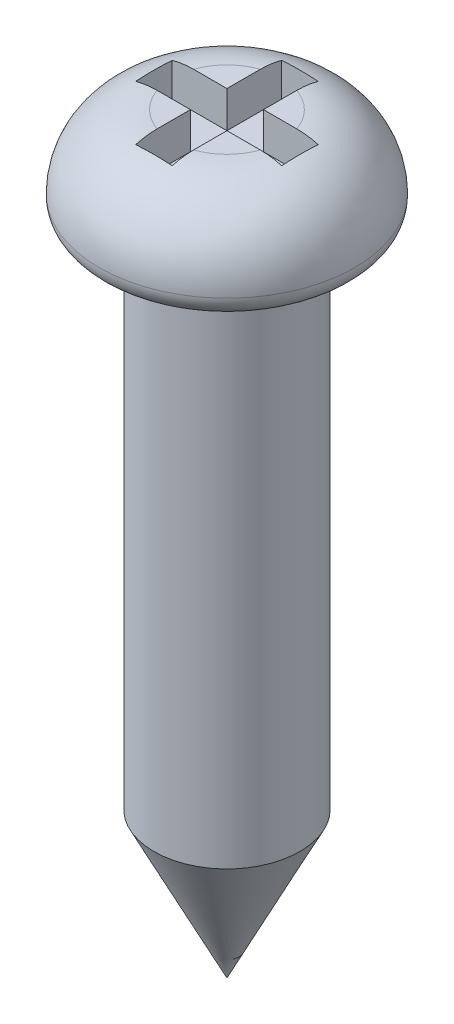
ISO-10303-21;
HEADER;
FILE_DESCRIPTION(('STEP AP214'),'2;1');
FILE_NAME('part.step','',(''),(''),'','','');
FILE_SCHEMA(('AUTOMOTIVE_DESIGN { 1 0 10303 214 1 1 1 1 }'));
ENDSEC;
DATA;
#1=APPLICATION_CONTEXT('core data for automotive mechanical design processes');
#2=APPLICATION_PROTOCOL_DEFINITION('international standard','automotive_design',2000,#1);
#3=PRODUCT_CONTEXT('',#1,'mechanical');
#4=PRODUCT('Part','Part','',(#3));
#5=PRODUCT_RELATED_PRODUCT_CATEGORY('part','',(#4));
#6=PRODUCT_DEFINITION_FORMATION('','',#4);
#7=PRODUCT_DEFINITION_CONTEXT('part definition',#1,'design');
#8=PRODUCT_DEFINITION('design','',#6,#7);
#9=PRODUCT_DEFINITION_SHAPE('','',#8);
#10=(LENGTH_UNIT() NAMED_UNIT(*) SI_UNIT(.MILLI.,.METRE.));
#11=(NAMED_UNIT(*) PLANE_ANGLE_UNIT() SI_UNIT($,.RADIAN.));
#12=(NAMED_UNIT(*) SI_UNIT($,.STERADIAN.) SOLID_ANGLE_UNIT());
#13=UNCERTAINTY_MEASURE_WITH_UNIT(LENGTH_MEASURE(1.E-05),#10,'distance_accuracy_value','');
#14=(GEOMETRIC_REPRESENTATION_CONTEXT(3) GLOBAL_UNCERTAINTY_ASSIGNED_CONTEXT((#13)) GLOBAL_UNIT_ASSIGNED_CONTEXT((#10,
#11,#12)) REPRESENTATION_CONTEXT('',''));
#15=CARTESIAN_POINT('',(0.,0.,0.));
#16=DIRECTION('',(0.,0.,1.));
#17=DIRECTION('',(1.,0.,0.));
#18=AXIS2_PLACEMENT_3D('',#15,#16,#17);
#19=CARTESIAN_POINT('',(0.,20.6,0.));
#20=DIRECTION('',(0.,1.,0.));
#21=DIRECTION('',(0.,0.,1.));
#22=AXIS2_PLACEMENT_3D('',#19,#20,#21);
#23=PLANE('',#22);
#24=DIRECTION('',(-1.,0.,0.));
#25=VECTOR('',#24,1.);
#26=CARTESIAN_POINT('',(2.,20.6,-0.500000000000001));
#27=LINE('',#26,#25);
#28=CARTESIAN_POINT('',(1.41421356237309,20.6,-0.5));
#29=VERTEX_POINT('',#28);
#30=CARTESIAN_POINT('',(0.5,20.6,-0.5));
#31=VERTEX_POINT('',#30);
#32=EDGE_CURVE('E196',#29,#31,#27,.T.);
#33=ORIENTED_EDGE('',*,*,#32,.F.);
#34=CARTESIAN_POINT('',(0.,20.6,0.));
#35=DIRECTION('',(0.,1.,0.));
#36=DIRECTION('',(0.,0.,1.));
#37=AXIS2_PLACEMENT_3D('',#34,#35,#36);
#38=CIRCLE('',#37,1.5);
#39=CARTESIAN_POINT('',(0.5,20.6,-1.41421356237309));
#40=VERTEX_POINT('',#39);
#41=EDGE_CURVE('E251',#29,#40,#38,.T.);
#42=ORIENTED_EDGE('',*,*,#41,.T.);
#43=DIRECTION('',(0.,0.,-1.));
#44=VECTOR('',#43,1.);
#45=CARTESIAN_POINT('',(0.5,20.6,-0.5));
#46=LINE('',#45,#44);
#47=EDGE_CURVE('E198',#31,#40,#46,.T.);
#48=ORIENTED_EDGE('',*,*,#47,.F.);
#49=EDGE_LOOP('',(#33,#42,#48));
#50=FACE_BOUND('',#49,.T.);
#51=ADVANCED_FACE('F32',(#50),#23,.T.);
#52=DIRECTION('',(0.,0.,1.));
#53=VECTOR('',#52,1.);
#54=CARTESIAN_POINT('',(-0.5,20.6,-0.5));
#55=LINE('',#54,#53);
#56=CARTESIAN_POINT('',(-0.5,20.6,-1.4142135623731));
#57=VERTEX_POINT('',#56);
#58=CARTESIAN_POINT('',(-0.5,20.6,-0.5));
#59=VERTEX_POINT('',#58);
#60=EDGE_CURVE('E201',#57,#59,#55,.T.);
#61=ORIENTED_EDGE('',*,*,#60,.F.);
#62=CARTESIAN_POINT('',(0.,20.6,0.));
#63=DIRECTION('',(0.,1.,0.));
#64=DIRECTION('',(0.,0.,1.));
#65=AXIS2_PLACEMENT_3D('',#62,#63,#64);
#66=CIRCLE('',#65,1.5);
#67=CARTESIAN_POINT('',(-1.41421356237309,20.6,-0.5));
#68=VERTEX_POINT('',#67);
#69=EDGE_CURVE('E249',#57,#68,#66,.T.);
#70=ORIENTED_EDGE('',*,*,#69,.T.);
#71=DIRECTION('',(-1.,0.,0.));
#72=VECTOR('',#71,1.);
#73=CARTESIAN_POINT('',(-2.,20.6,-0.5));
#74=LINE('',#73,#72);
#75=EDGE_CURVE('E203',#59,#68,#74,.T.);
#76=ORIENTED_EDGE('',*,*,#75,.F.);
#77=EDGE_LOOP('',(#61,#70,#76));
#78=FACE_BOUND('',#77,.T.);
#79=ADVANCED_FACE('F428',(#78),#23,.T.);
#80=DIRECTION('',(1.,0.,0.));
#81=VECTOR('',#80,1.);
#82=CARTESIAN_POINT('',(-2.,20.6,0.5));
#83=LINE('',#82,#81);
#84=CARTESIAN_POINT('',(-1.41421356237309,20.6,0.5));
#85=VERTEX_POINT('',#84);
#86=CARTESIAN_POINT('',(-0.5,20.6,0.5));
#87=VERTEX_POINT('',#86);
#88=EDGE_CURVE('E206',#85,#87,#83,.T.);
#89=ORIENTED_EDGE('',*,*,#88,.F.);
#90=CARTESIAN_POINT('',(0.,20.6,0.));
#91=DIRECTION('',(0.,1.,0.));
#92=DIRECTION('',(0.,0.,1.));
#93=AXIS2_PLACEMENT_3D('',#90,#91,#92);
#94=CIRCLE('',#93,1.5);
#95=CARTESIAN_POINT('',(-0.5,20.6,1.4142135623731));
#96=VERTEX_POINT('',#95);
#97=EDGE_CURVE('E247',#85,#96,#94,.T.);
#98=ORIENTED_EDGE('',*,*,#97,.T.);
#99=DIRECTION('',(0.,0.,1.));
#100=VECTOR('',#99,1.);
#101=CARTESIAN_POINT('',(-0.5,20.6,0.5));
#102=LINE('',#101,#100);
#103=EDGE_CURVE('E208',#87,#96,#102,.T.);
#104=ORIENTED_EDGE('',*,*,#103,.F.);
#105=EDGE_LOOP('',(#89,#98,#104));
#106=FACE_BOUND('',#105,.T.);
#107=ADVANCED_FACE('F433',(#106),#23,.T.);
#108=CARTESIAN_POINT('',(0.,18.,0.));
#109=DIRECTION('',(0.,-1.,0.));
#110=DIRECTION('',(0.,0.,-1.));
#111=AXIS2_PLACEMENT_3D('',#108,#109,#110);
#112=CYLINDRICAL_SURFACE('',#111,2.);
#113=CARTESIAN_POINT('',(0.,4.00000000000003,0.));
#114=DIRECTION('',(0.,1.,0.));
#115=DIRECTION('',(0.,0.,1.));
#116=AXIS2_PLACEMENT_3D('',#113,#114,#115);
#117=CIRCLE('',#116,2.);
#118=CARTESIAN_POINT('',(0.,4.00000000000003,2.));
#119=VERTEX_POINT('',#118);
#120=EDGE_CURVE('E11',#119,#119,#117,.T.);
#121=ORIENTED_EDGE('',*,*,#120,.T.);
#122=EDGE_LOOP('',(#121));
#123=FACE_BOUND('',#122,.T.);
#124=CARTESIAN_POINT('',(0.,18.,0.));
#125=DIRECTION('',(0.,1.,0.));
#126=DIRECTION('',(0.,0.,1.));
#127=AXIS2_PLACEMENT_3D('',#124,#125,#126);
#128=CIRCLE('',#127,2.);
#129=CARTESIAN_POINT('',(0.,18.,2.));
#130=VERTEX_POINT('',#129);
#131=EDGE_CURVE('E214',#130,#130,#128,.T.);
#132=ORIENTED_EDGE('',*,*,#131,.F.);
#133=EDGE_LOOP('',(#132));
#134=FACE_BOUND('',#133,.T.);
#135=ADVANCED_FACE('F435',(#123,#134),#112,.T.);
#136=DIRECTION('',(0.,0.,-1.));
#137=VECTOR('',#136,1.);
#138=CARTESIAN_POINT('',(0.5,20.6,0.5));
#139=LINE('',#138,#137);
#140=CARTESIAN_POINT('',(0.5,20.6,1.41421356237309));
#141=VERTEX_POINT('',#140);
#142=CARTESIAN_POINT('',(0.5,20.6,0.5));
#143=VERTEX_POINT('',#142);
#144=EDGE_CURVE('E168',#141,#143,#139,.T.);
#145=ORIENTED_EDGE('',*,*,#144,.F.);
#146=CARTESIAN_POINT('',(0.,20.6,0.));
#147=DIRECTION('',(0.,1.,0.));
#148=DIRECTION('',(0.,0.,1.));
#149=AXIS2_PLACEMENT_3D('',#146,#147,#148);
#150=CIRCLE('',#149,1.5);
#151=CARTESIAN_POINT('',(1.41421356237309,20.6,0.5));
#152=VERTEX_POINT('',#151);
#153=EDGE_CURVE('E245',#141,#152,#150,.T.);
#154=ORIENTED_EDGE('',*,*,#153,.T.);
#155=DIRECTION('',(1.,0.,0.));
#156=VECTOR('',#155,1.);
#157=CARTESIAN_POINT('',(2.,20.6,0.500000000000001));
#158=LINE('',#157,#156);
#159=EDGE_CURVE('E165',#143,#152,#158,.T.);
#160=ORIENTED_EDGE('',*,*,#159,.F.);
#161=EDGE_LOOP('',(#145,#154,#160));
#162=FACE_BOUND('',#161,.T.);
#163=ADVANCED_FACE('F358',(#162),#23,.T.);
#164=CARTESIAN_POINT('',(0.,18.,0.));
#165=DIRECTION('',(0.,1.,0.));
#166=DIRECTION('',(0.,0.,1.));
#167=AXIS2_PLACEMENT_3D('',#164,#165,#166);
#168=PLANE('',#167);
#169=CARTESIAN_POINT('',(0.,18.,0.));
#170=DIRECTION('',(0.,1.,0.));
#171=DIRECTION('',(0.,0.,1.));
#172=AXIS2_PLACEMENT_3D('',#169,#170,#171);
#173=CIRCLE('',#172,2.9);
#174=CARTESIAN_POINT('',(0.,18.,2.9));
#175=VERTEX_POINT('',#174);
#176=EDGE_CURVE('E41',#175,#175,#173,.F.);
#177=ORIENTED_EDGE('',*,*,#176,.T.);
#178=EDGE_LOOP('',(#177));
#179=FACE_BOUND('',#178,.T.);
#180=ORIENTED_EDGE('',*,*,#131,.T.);
#181=EDGE_LOOP('',(#180));
#182=FACE_BOUND('',#181,.T.);
#183=ADVANCED_FACE('F303',(#179,#182),#168,.F.);
#184=CARTESIAN_POINT('',(2.,19.6,0.500000000000001));
#185=DIRECTION('',(1.,0.,0.));
#186=DIRECTION('',(0.,0.,-1.));
#187=AXIS2_PLACEMENT_3D('',#184,#185,#186);
#188=PLANE('',#187);
#189=DIRECTION('',(0.,1.,0.));
#190=VECTOR('',#189,1.);
#191=CARTESIAN_POINT('',(2.,19.6,0.500000000000001));
#192=LINE('',#191,#190);
#193=CARTESIAN_POINT('',(2.,19.6,0.500000000000001));
#194=VERTEX_POINT('',#193);
#195=CARTESIAN_POINT('',(2.,20.5195464147622,0.500000000000001));
#196=VERTEX_POINT('',#195);
#197=EDGE_CURVE('E212',#194,#196,#192,.T.);
#198=ORIENTED_EDGE('',*,*,#197,.T.);
#199=CARTESIAN_POINT('',(2.,20.5195464147622,0.500000000000001));
#200=CARTESIAN_POINT('',(2.,20.5224970676557,0.458378671813178));
#201=CARTESIAN_POINT('',(2.,20.5250215497628,0.416729207360736));
#202=CARTESIAN_POINT('',(2.,20.5292855228046,0.333392233303626));
#203=CARTESIAN_POINT('',(2.,20.5310250575782,0.291704725953959));
#204=CARTESIAN_POINT('',(2.,20.5351644590106,0.166702540795925));
#205=CARTESIAN_POINT('',(2.,20.5364916731041,0.0833512703979624));
#206=CARTESIAN_POINT('',(2.,20.5364916731041,-0.0833512703979625));
#207=CARTESIAN_POINT('',(2.,20.5351644590106,-0.166702540795925));
#208=CARTESIAN_POINT('',(2.,20.5310250575782,-0.29170472595396));
#209=CARTESIAN_POINT('',(2.,20.5292855228046,-0.333392233303626));
#210=CARTESIAN_POINT('',(2.,20.5250215497628,-0.416729207360736));
#211=CARTESIAN_POINT('',(2.,20.5224970676557,-0.458378671813178));
#212=CARTESIAN_POINT('',(2.,20.5195464147622,-0.500000000000001));
#213=B_SPLINE_CURVE_WITH_KNOTS('',3,(#199,#200,#201,#202,#203,#204,#205,#206,#207,#208,#209,
#210,#211,#212),.UNSPECIFIED.,.F.,.F.,(4,2,2,2,2,2,4),(0.,0.125171816342304,0.25033664105819,
0.500375007900453,0.750413374742716,0.875578199458602,1.00075001580091),.UNSPECIFIED.);
#214=CARTESIAN_POINT('',(2.,20.5195464147622,-0.500000000000001));
#215=VERTEX_POINT('',#214);
#216=EDGE_CURVE('E48',#196,#215,#213,.T.);
#217=ORIENTED_EDGE('',*,*,#216,.T.);
#218=DIRECTION('',(0.,1.,0.));
#219=VECTOR('',#218,1.);
#220=CARTESIAN_POINT('',(2.,19.6,-0.500000000000001));
#221=LINE('',#220,#219);
#222=CARTESIAN_POINT('',(2.,19.6,-0.500000000000001));
#223=VERTEX_POINT('',#222);
#224=EDGE_CURVE('E142',#223,#215,#221,.T.);
#225=ORIENTED_EDGE('',*,*,#224,.F.);
#226=DIRECTION('',(0.,0.,-1.));
#227=VECTOR('',#226,1.);
#228=CARTESIAN_POINT('',(2.,19.6,0.500000000000001));
#229=LINE('',#228,#227);
#230=EDGE_CURVE('E146',#194,#223,#229,.T.);
#231=ORIENTED_EDGE('',*,*,#230,.F.);
#232=EDGE_LOOP('',(#198,#217,#225,#231));
#233=FACE_BOUND('',#232,.T.);
#234=ADVANCED_FACE('F144',(#233),#188,.F.);
#235=CARTESIAN_POINT('',(2.,19.6,0.500000000000001));
#236=DIRECTION('',(0.,0.,1.));
#237=DIRECTION('',(1.,0.,0.));
#238=AXIS2_PLACEMENT_3D('',#235,#236,#237);
#239=PLANE('',#238);
#240=ORIENTED_EDGE('',*,*,#159,.T.);
#241=CARTESIAN_POINT('',(1.41421356237309,20.6,0.5));
#242=CARTESIAN_POINT('',(1.46375615743054,20.6000070689108,0.5));
#243=CARTESIAN_POINT('',(1.51330434834056,20.5983633204468,0.5));
#244=CARTESIAN_POINT('',(1.61193792031053,20.5917309717592,0.5));
#245=CARTESIAN_POINT('',(1.66102438159266,20.5867583692002,0.5));
#246=CARTESIAN_POINT('',(1.75874536339047,20.5734251791423,0.5));
#247=CARTESIAN_POINT('',(1.80737981285619,20.5650640679313,0.500000000000001));
#248=CARTESIAN_POINT('',(1.90417272790122,20.5449002288909,0.500000000000001));
#249=CARTESIAN_POINT('',(1.9523277930296,20.5330811910921,0.500000000000001));
#250=CARTESIAN_POINT('',(2.,20.5195464147622,0.500000000000001));
#251=B_SPLINE_CURVE_WITH_KNOTS('',3,(#241,#242,#243,#244,#245,#246,#247,#248,#249,#250),
.UNSPECIFIED.,.F.,.F.,(4,2,2,2,4),(0.,0.148608335467937,0.29650757384445,0.44442967956415,
0.593061056668036),.UNSPECIFIED.);
#252=EDGE_CURVE('E361',#152,#196,#251,.T.);
#253=ORIENTED_EDGE('',*,*,#252,.T.);
#254=ORIENTED_EDGE('',*,*,#197,.F.);
#255=DIRECTION('',(1.,0.,0.));
#256=VECTOR('',#255,1.);
#257=CARTESIAN_POINT('',(2.,19.6,0.500000000000001));
#258=LINE('',#257,#256);
#259=CARTESIAN_POINT('',(0.5,19.6,0.5));
#260=VERTEX_POINT('',#259);
#261=EDGE_CURVE('E151',#260,#194,#258,.T.);
#262=ORIENTED_EDGE('',*,*,#261,.F.);
#263=DIRECTION('',(0.,1.,0.));
#264=VECTOR('',#263,1.);
#265=CARTESIAN_POINT('',(0.5,19.6,0.5));
#266=LINE('',#265,#264);
#267=EDGE_CURVE('E215',#260,#143,#266,.T.);
#268=ORIENTED_EDGE('',*,*,#267,.T.);
#269=EDGE_LOOP('',(#240,#253,#254,#262,#268));
#270=FACE_BOUND('',#269,.T.);
#271=ADVANCED_FACE('F355',(#270),#239,.F.);
#272=CARTESIAN_POINT('',(0.5,19.6,0.5));
#273=DIRECTION('',(1.,0.,0.));
#274=DIRECTION('',(0.,0.,-1.));
#275=AXIS2_PLACEMENT_3D('',#272,#273,#274);
#276=PLANE('',#275);
#277=DIRECTION('',(0.,1.,0.));
#278=VECTOR('',#277,1.);
#279=CARTESIAN_POINT('',(0.5,19.6,2.));
#280=LINE('',#279,#278);
#281=CARTESIAN_POINT('',(0.5,19.6,2.));
#282=VERTEX_POINT('',#281);
#283=CARTESIAN_POINT('',(0.5,20.5195464147622,2.));
#284=VERTEX_POINT('',#283);
#285=EDGE_CURVE('E218',#282,#284,#280,.T.);
#286=ORIENTED_EDGE('',*,*,#285,.T.);
#287=CARTESIAN_POINT('',(0.5,20.5195464147622,2.));
#288=CARTESIAN_POINT('',(0.5,20.5330811910921,1.9523277930296));
#289=CARTESIAN_POINT('',(0.5,20.5449002288909,1.90417272790122));
#290=CARTESIAN_POINT('',(0.5,20.5650640679313,1.80737981285619));
#291=CARTESIAN_POINT('',(0.5,20.5734251791423,1.75874536339047));
#292=CARTESIAN_POINT('',(0.5,20.5867583692002,1.66102438159266));
#293=CARTESIAN_POINT('',(0.5,20.5917309717592,1.61193792031053));
#294=CARTESIAN_POINT('',(0.5,20.5983633204468,1.51330434834056));
#295=CARTESIAN_POINT('',(0.5,20.6000070689108,1.46375615743054));
#296=CARTESIAN_POINT('',(0.5,20.6,1.41421356237309));
#297=B_SPLINE_CURVE_WITH_KNOTS('',3,(#287,#288,#289,#290,#291,#292,#293,#294,#295,#296),
.UNSPECIFIED.,.F.,.F.,(4,2,2,2,4),(0.,0.148631377103885,0.296553482823585,0.444452721200099,
0.593061056668035),.UNSPECIFIED.);
#298=EDGE_CURVE('E360',#284,#141,#297,.T.);
#299=ORIENTED_EDGE('',*,*,#298,.T.);
#300=ORIENTED_EDGE('',*,*,#144,.T.);
#301=ORIENTED_EDGE('',*,*,#267,.F.);
#302=DIRECTION('',(0.,0.,-1.));
#303=VECTOR('',#302,1.);
#304=CARTESIAN_POINT('',(0.5,19.6,0.5));
#305=LINE('',#304,#303);
#306=EDGE_CURVE('E193',#282,#260,#305,.T.);
#307=ORIENTED_EDGE('',*,*,#306,.F.);
#308=EDGE_LOOP('',(#286,#299,#300,#301,#307));
#309=FACE_BOUND('',#308,.T.);
#310=ADVANCED_FACE('F351',(#309),#276,.F.);
#311=CARTESIAN_POINT('',(-0.5,19.6,2.));
#312=DIRECTION('',(0.,0.,1.));
#313=DIRECTION('',(1.,0.,0.));
#314=AXIS2_PLACEMENT_3D('',#311,#312,#313);
#315=PLANE('',#314);
#316=DIRECTION('',(0.,1.,0.));
#317=VECTOR('',#316,1.);
#318=CARTESIAN_POINT('',(-0.5,19.6,2.));
#319=LINE('',#318,#317);
#320=CARTESIAN_POINT('',(-0.5,19.6,2.));
#321=VERTEX_POINT('',#320);
#322=CARTESIAN_POINT('',(-0.5,20.5195464147622,2.));
#323=VERTEX_POINT('',#322);
#324=EDGE_CURVE('E221',#321,#323,#319,.T.);
#325=ORIENTED_EDGE('',*,*,#324,.T.);
#326=CARTESIAN_POINT('',(-0.5,20.5195464147622,2.));
#327=CARTESIAN_POINT('',(-0.458378671813177,20.5224970676557,2.));
#328=CARTESIAN_POINT('',(-0.416729207360735,20.5250215497628,2.));
#329=CARTESIAN_POINT('',(-0.333392233303625,20.5292855228046,2.));
#330=CARTESIAN_POINT('',(-0.291704725953959,20.5310250575782,2.));
#331=CARTESIAN_POINT('',(-0.166702540795925,20.5351644590106,2.));
#332=CARTESIAN_POINT('',(-0.0833512703979621,20.5364916731041,2.));
#333=CARTESIAN_POINT('',(0.0833512703979625,20.5364916731041,2.));
#334=CARTESIAN_POINT('',(0.166702540795925,20.5351644590106,2.));
#335=CARTESIAN_POINT('',(0.291704725953959,20.5310250575782,2.));
#336=CARTESIAN_POINT('',(0.333392233303625,20.5292855228046,2.));
#337=CARTESIAN_POINT('',(0.416729207360735,20.5250215497628,2.));
#338=CARTESIAN_POINT('',(0.458378671813178,20.5224970676557,2.));
#339=CARTESIAN_POINT('',(0.5,20.5195464147622,2.));
#340=B_SPLINE_CURVE_WITH_KNOTS('',3,(#326,#327,#328,#329,#330,#331,#332,#333,#334,#335,#336,
#337,#338,#339),.UNSPECIFIED.,.F.,.F.,(4,2,2,2,2,2,4),(0.,0.125171816342304,0.250336641058189,
0.500375007900452,0.750413374742715,0.8755781994586,1.0007500158009),.UNSPECIFIED.);
#341=EDGE_CURVE('E348',#323,#284,#340,.T.);
#342=ORIENTED_EDGE('',*,*,#341,.T.);
#343=ORIENTED_EDGE('',*,*,#285,.F.);
#344=DIRECTION('',(1.,0.,0.));
#345=VECTOR('',#344,1.);
#346=CARTESIAN_POINT('',(-0.5,19.6,2.));
#347=LINE('',#346,#345);
#348=EDGE_CURVE('E190',#321,#282,#347,.T.);
#349=ORIENTED_EDGE('',*,*,#348,.F.);
#350=EDGE_LOOP('',(#325,#342,#343,#349));
#351=FACE_BOUND('',#350,.T.);
#352=ADVANCED_FACE('F346',(#351),#315,.F.);
#353=CARTESIAN_POINT('',(-0.5,19.6,0.5));
#354=DIRECTION('',(-1.,0.,0.));
#355=DIRECTION('',(0.,0.,1.));
#356=AXIS2_PLACEMENT_3D('',#353,#354,#355);
#357=PLANE('',#356);
#358=ORIENTED_EDGE('',*,*,#103,.T.);
#359=CARTESIAN_POINT('',(-0.5,20.6,1.4142135623731));
#360=CARTESIAN_POINT('',(-0.5,20.6000070689108,1.46375615743054));
#361=CARTESIAN_POINT('',(-0.5,20.5983633204468,1.51330434834056));
#362=CARTESIAN_POINT('',(-0.5,20.5917309717592,1.61193792031053));
#363=CARTESIAN_POINT('',(-0.5,20.5867583692002,1.66102438159266));
#364=CARTESIAN_POINT('',(-0.5,20.5734251791423,1.75874536339047));
#365=CARTESIAN_POINT('',(-0.5,20.5650640679313,1.80737981285619));
#366=CARTESIAN_POINT('',(-0.5,20.5449002288909,1.90417272790122));
#367=CARTESIAN_POINT('',(-0.5,20.5330811910921,1.9523277930296));
#368=CARTESIAN_POINT('',(-0.5,20.5195464147622,2.));
#369=B_SPLINE_CURVE_WITH_KNOTS('',3,(#359,#360,#361,#362,#363,#364,#365,#366,#367,#368),
.UNSPECIFIED.,.F.,.F.,(4,2,2,2,4),(0.,0.148608335467936,0.29650757384445,0.44442967956415,
0.593061056668035),.UNSPECIFIED.);
#370=EDGE_CURVE('E390',#96,#323,#369,.T.);
#371=ORIENTED_EDGE('',*,*,#370,.T.);
#372=ORIENTED_EDGE('',*,*,#324,.F.);
#373=DIRECTION('',(0.,0.,1.));
#374=VECTOR('',#373,1.);
#375=CARTESIAN_POINT('',(-0.5,19.6,0.5));
#376=LINE('',#375,#374);
#377=CARTESIAN_POINT('',(-0.5,19.6,0.5));
#378=VERTEX_POINT('',#377);
#379=EDGE_CURVE('E187',#378,#321,#376,.T.);
#380=ORIENTED_EDGE('',*,*,#379,.F.);
#381=DIRECTION('',(0.,1.,0.));
#382=VECTOR('',#381,1.);
#383=CARTESIAN_POINT('',(-0.5,19.6,0.5));
#384=LINE('',#383,#382);
#385=EDGE_CURVE('E224',#378,#87,#384,.T.);
#386=ORIENTED_EDGE('',*,*,#385,.T.);
#387=EDGE_LOOP('',(#358,#371,#372,#380,#386));
#388=FACE_BOUND('',#387,.T.);
#389=ADVANCED_FACE('F342',(#388),#357,.F.);
#390=CARTESIAN_POINT('',(-2.,19.6,0.5));
#391=DIRECTION('',(0.,0.,1.));
#392=DIRECTION('',(1.,0.,0.));
#393=AXIS2_PLACEMENT_3D('',#390,#391,#392);
#394=PLANE('',#393);
#395=DIRECTION('',(0.,1.,0.));
#396=VECTOR('',#395,1.);
#397=CARTESIAN_POINT('',(-2.,19.6,0.5));
#398=LINE('',#397,#396);
#399=CARTESIAN_POINT('',(-2.,19.6,0.5));
#400=VERTEX_POINT('',#399);
#401=CARTESIAN_POINT('',(-2.,20.5195464147622,0.5));
#402=VERTEX_POINT('',#401);
#403=EDGE_CURVE('E227',#400,#402,#398,.T.);
#404=ORIENTED_EDGE('',*,*,#403,.T.);
#405=CARTESIAN_POINT('',(-2.,20.5195464147622,0.5));
#406=CARTESIAN_POINT('',(-1.9523277930296,20.5330811910921,0.5));
#407=CARTESIAN_POINT('',(-1.90417272790122,20.5449002288909,0.5));
#408=CARTESIAN_POINT('',(-1.80737981285619,20.5650640679313,0.5));
#409=CARTESIAN_POINT('',(-1.75874536339047,20.5734251791423,0.5));
#410=CARTESIAN_POINT('',(-1.66102438159266,20.5867583692002,0.5));
#411=CARTESIAN_POINT('',(-1.61193792031053,20.5917309717592,0.5));
#412=CARTESIAN_POINT('',(-1.51330434834056,20.5983633204468,0.5));
#413=CARTESIAN_POINT('',(-1.46375615743054,20.6000070689108,0.5));
#414=CARTESIAN_POINT('',(-1.4142135623731,20.6,0.5));
#415=B_SPLINE_CURVE_WITH_KNOTS('',3,(#405,#406,#407,#408,#409,#410,#411,#412,#413,#414),
.UNSPECIFIED.,.F.,.F.,(4,2,2,2,4),(0.,0.148631377103885,0.296553482823585,0.444452721200099,
0.593061056668035),.UNSPECIFIED.);
#416=EDGE_CURVE('E396',#402,#85,#415,.T.);
#417=ORIENTED_EDGE('',*,*,#416,.T.);
#418=ORIENTED_EDGE('',*,*,#88,.T.);
#419=ORIENTED_EDGE('',*,*,#385,.F.);
#420=DIRECTION('',(1.,0.,0.));
#421=VECTOR('',#420,1.);
#422=CARTESIAN_POINT('',(-2.,19.6,0.5));
#423=LINE('',#422,#421);
#424=EDGE_CURVE('E184',#400,#378,#423,.T.);
#425=ORIENTED_EDGE('',*,*,#424,.F.);
#426=EDGE_LOOP('',(#404,#417,#418,#419,#425));
#427=FACE_BOUND('',#426,.T.);
#428=ADVANCED_FACE('F337',(#427),#394,.F.);
#429=CARTESIAN_POINT('',(-2.,19.6,0.5));
#430=DIRECTION('',(-1.,0.,0.));
#431=DIRECTION('',(0.,0.,1.));
#432=AXIS2_PLACEMENT_3D('',#429,#430,#431);
#433=PLANE('',#432);
#434=DIRECTION('',(0.,1.,0.));
#435=VECTOR('',#434,1.);
#436=CARTESIAN_POINT('',(-2.,19.6,-0.5));
#437=LINE('',#436,#435);
#438=CARTESIAN_POINT('',(-2.,19.6,-0.5));
#439=VERTEX_POINT('',#438);
#440=CARTESIAN_POINT('',(-2.,20.5195464147622,-0.5));
#441=VERTEX_POINT('',#440);
#442=EDGE_CURVE('E230',#439,#441,#437,.T.);
#443=ORIENTED_EDGE('',*,*,#442,.T.);
#444=CARTESIAN_POINT('',(-2.,20.5195464147622,-0.5));
#445=CARTESIAN_POINT('',(-2.,20.5224970676557,-0.458378671813178));
#446=CARTESIAN_POINT('',(-2.,20.5250215497628,-0.416729207360735));
#447=CARTESIAN_POINT('',(-2.,20.5292855228046,-0.333392233303625));
#448=CARTESIAN_POINT('',(-2.,20.5310250575782,-0.291704725953959));
#449=CARTESIAN_POINT('',(-2.,20.5351644590106,-0.166702540795925));
#450=CARTESIAN_POINT('',(-2.,20.5364916731041,-0.0833512703979624));
#451=CARTESIAN_POINT('',(-2.,20.5364916731041,0.0833512703979623));
#452=CARTESIAN_POINT('',(-2.,20.5351644590106,0.166702540795925));
#453=CARTESIAN_POINT('',(-2.,20.5310250575782,0.291704725953959));
#454=CARTESIAN_POINT('',(-2.,20.5292855228046,0.333392233303625));
#455=CARTESIAN_POINT('',(-2.,20.5250215497628,0.416729207360735));
#456=CARTESIAN_POINT('',(-2.,20.5224970676557,0.458378671813178));
#457=CARTESIAN_POINT('',(-2.,20.5195464147622,0.5));
#458=B_SPLINE_CURVE_WITH_KNOTS('',3,(#444,#445,#446,#447,#448,#449,#450,#451,#452,#453,#454,
#455,#456,#457),.UNSPECIFIED.,.F.,.F.,(4,2,2,2,2,2,4),(0.,0.125171816342304,0.250336641058189,
0.500375007900452,0.750413374742715,0.875578199458601,1.0007500158009),.UNSPECIFIED.);
#459=EDGE_CURVE('E334',#441,#402,#458,.T.);
#460=ORIENTED_EDGE('',*,*,#459,.T.);
#461=ORIENTED_EDGE('',*,*,#403,.F.);
#462=DIRECTION('',(0.,0.,1.));
#463=VECTOR('',#462,1.);
#464=CARTESIAN_POINT('',(-2.,19.6,0.5));
#465=LINE('',#464,#463);
#466=EDGE_CURVE('E181',#439,#400,#465,.T.);
#467=ORIENTED_EDGE('',*,*,#466,.F.);
#468=EDGE_LOOP('',(#443,#460,#461,#467));
#469=FACE_BOUND('',#468,.T.);
#470=ADVANCED_FACE('F332',(#469),#433,.F.);
#471=CARTESIAN_POINT('',(-2.,19.6,-0.5));
#472=DIRECTION('',(0.,0.,-1.));
#473=DIRECTION('',(-1.,0.,0.));
#474=AXIS2_PLACEMENT_3D('',#471,#472,#473);
#475=PLANE('',#474);
#476=ORIENTED_EDGE('',*,*,#75,.T.);
#477=CARTESIAN_POINT('',(-1.41421356237309,20.6,-0.5));
#478=CARTESIAN_POINT('',(-1.46375615743054,20.6000070689108,-0.5));
#479=CARTESIAN_POINT('',(-1.51330434834056,20.5983633204468,-0.5));
#480=CARTESIAN_POINT('',(-1.61193792031053,20.5917309717592,-0.5));
#481=CARTESIAN_POINT('',(-1.66102438159266,20.5867583692002,-0.5));
#482=CARTESIAN_POINT('',(-1.75874536339047,20.5734251791423,-0.5));
#483=CARTESIAN_POINT('',(-1.80737981285619,20.5650640679313,-0.5));
#484=CARTESIAN_POINT('',(-1.90417272790122,20.5449002288909,-0.5));
#485=CARTESIAN_POINT('',(-1.9523277930296,20.5330811910921,-0.5));
#486=CARTESIAN_POINT('',(-2.,20.5195464147622,-0.5));
#487=B_SPLINE_CURVE_WITH_KNOTS('',3,(#477,#478,#479,#480,#481,#482,#483,#484,#485,#486),
.UNSPECIFIED.,.F.,.F.,(4,2,2,2,4),(0.,0.148608335467936,0.29650757384445,0.44442967956415,
0.593061056668035),.UNSPECIFIED.);
#488=EDGE_CURVE('E416',#68,#441,#487,.T.);
#489=ORIENTED_EDGE('',*,*,#488,.T.);
#490=ORIENTED_EDGE('',*,*,#442,.F.);
#491=DIRECTION('',(-1.,0.,0.));
#492=VECTOR('',#491,1.);
#493=CARTESIAN_POINT('',(-2.,19.6,-0.5));
#494=LINE('',#493,#492);
#495=CARTESIAN_POINT('',(-0.5,19.6,-0.5));
#496=VERTEX_POINT('',#495);
#497=EDGE_CURVE('E178',#496,#439,#494,.T.);
#498=ORIENTED_EDGE('',*,*,#497,.F.);
#499=DIRECTION('',(0.,1.,0.));
#500=VECTOR('',#499,1.);
#501=CARTESIAN_POINT('',(-0.5,19.6,-0.5));
#502=LINE('',#501,#500);
#503=EDGE_CURVE('E233',#496,#59,#502,.T.);
#504=ORIENTED_EDGE('',*,*,#503,.T.);
#505=EDGE_LOOP('',(#476,#489,#490,#498,#504));
#506=FACE_BOUND('',#505,.T.);
#507=ADVANCED_FACE('F328',(#506),#475,.F.);
#508=CARTESIAN_POINT('',(-0.5,19.6,-0.5));
#509=DIRECTION('',(-1.,0.,0.));
#510=DIRECTION('',(0.,0.,1.));
#511=AXIS2_PLACEMENT_3D('',#508,#509,#510);
#512=PLANE('',#511);
#513=DIRECTION('',(0.,1.,0.));
#514=VECTOR('',#513,1.);
#515=CARTESIAN_POINT('',(-0.5,19.6,-2.));
#516=LINE('',#515,#514);
#517=CARTESIAN_POINT('',(-0.5,19.6,-2.));
#518=VERTEX_POINT('',#517);
#519=CARTESIAN_POINT('',(-0.5,20.5195464147622,-2.));
#520=VERTEX_POINT('',#519);
#521=EDGE_CURVE('E236',#518,#520,#516,.T.);
#522=ORIENTED_EDGE('',*,*,#521,.T.);
#523=CARTESIAN_POINT('',(-0.5,20.5195464147622,-2.));
#524=CARTESIAN_POINT('',(-0.5,20.5330811910921,-1.9523277930296));
#525=CARTESIAN_POINT('',(-0.5,20.5449002288909,-1.90417272790122));
#526=CARTESIAN_POINT('',(-0.5,20.5650640679313,-1.80737981285619));
#527=CARTESIAN_POINT('',(-0.5,20.5734251791423,-1.75874536339047));
#528=CARTESIAN_POINT('',(-0.5,20.5867583692002,-1.66102438159266));
#529=CARTESIAN_POINT('',(-0.5,20.5917309717592,-1.61193792031053));
#530=CARTESIAN_POINT('',(-0.5,20.5983633204468,-1.51330434834056));
#531=CARTESIAN_POINT('',(-0.5,20.6000070689108,-1.46375615743054));
#532=CARTESIAN_POINT('',(-0.5,20.6,-1.4142135623731));
#533=B_SPLINE_CURVE_WITH_KNOTS('',3,(#523,#524,#525,#526,#527,#528,#529,#530,#531,#532),
.UNSPECIFIED.,.F.,.F.,(4,2,2,2,4),(0.,0.148631377103885,0.296553482823585,0.444452721200099,
0.593061056668035),.UNSPECIFIED.);
#534=EDGE_CURVE('E421',#520,#57,#533,.T.);
#535=ORIENTED_EDGE('',*,*,#534,.T.);
#536=ORIENTED_EDGE('',*,*,#60,.T.);
#537=ORIENTED_EDGE('',*,*,#503,.F.);
#538=DIRECTION('',(0.,0.,1.));
#539=VECTOR('',#538,1.);
#540=CARTESIAN_POINT('',(-0.5,19.6,-0.5));
#541=LINE('',#540,#539);
#542=EDGE_CURVE('E175',#518,#496,#541,.T.);
#543=ORIENTED_EDGE('',*,*,#542,.F.);
#544=EDGE_LOOP('',(#522,#535,#536,#537,#543));
#545=FACE_BOUND('',#544,.T.);
#546=ADVANCED_FACE('F323',(#545),#512,.F.);
#547=CARTESIAN_POINT('',(-0.5,19.6,-2.));
#548=DIRECTION('',(0.,0.,-1.));
#549=DIRECTION('',(-1.,0.,0.));
#550=AXIS2_PLACEMENT_3D('',#547,#548,#549);
#551=PLANE('',#550);
#552=DIRECTION('',(0.,1.,0.));
#553=VECTOR('',#552,1.);
#554=CARTESIAN_POINT('',(0.5,19.6,-2.));
#555=LINE('',#554,#553);
#556=CARTESIAN_POINT('',(0.5,19.6,-2.));
#557=VERTEX_POINT('',#556);
#558=CARTESIAN_POINT('',(0.5,20.5195464147622,-2.));
#559=VERTEX_POINT('',#558);
#560=EDGE_CURVE('E239',#557,#559,#555,.T.);
#561=ORIENTED_EDGE('',*,*,#560,.T.);
#562=CARTESIAN_POINT('',(0.5,20.5195464147622,-2.));
#563=CARTESIAN_POINT('',(0.458378671813178,20.5224970676557,-2.));
#564=CARTESIAN_POINT('',(0.416729207360736,20.5250215497628,-2.));
#565=CARTESIAN_POINT('',(0.333392233303625,20.5292855228046,-2.));
#566=CARTESIAN_POINT('',(0.291704725953959,20.5310250575782,-2.));
#567=CARTESIAN_POINT('',(0.166702540795925,20.5351644590106,-2.));
#568=CARTESIAN_POINT('',(0.0833512703979626,20.5364916731041,-2.));
#569=CARTESIAN_POINT('',(-0.0833512703979621,20.5364916731041,-2.));
#570=CARTESIAN_POINT('',(-0.166702540795924,20.5351644590106,-2.));
#571=CARTESIAN_POINT('',(-0.291704725953959,20.5310250575782,-2.));
#572=CARTESIAN_POINT('',(-0.333392233303625,20.5292855228046,-2.));
#573=CARTESIAN_POINT('',(-0.416729207360735,20.5250215497628,-2.));
#574=CARTESIAN_POINT('',(-0.458378671813177,20.5224970676557,-2.));
#575=CARTESIAN_POINT('',(-0.499999999999999,20.5195464147622,-2.));
#576=B_SPLINE_CURVE_WITH_KNOTS('',3,(#562,#563,#564,#565,#566,#567,#568,#569,#570,#571,#572,
#573,#574,#575),.UNSPECIFIED.,.F.,.F.,(4,2,2,2,2,2,4),(0.,0.125171816342304,0.250336641058189,
0.500375007900452,0.750413374742715,0.875578199458601,1.0007500158009),.UNSPECIFIED.);
#577=EDGE_CURVE('E262',#559,#520,#576,.T.);
#578=ORIENTED_EDGE('',*,*,#577,.T.);
#579=ORIENTED_EDGE('',*,*,#521,.F.);
#580=DIRECTION('',(-1.,0.,0.));
#581=VECTOR('',#580,1.);
#582=CARTESIAN_POINT('',(-0.5,19.6,-2.));
#583=LINE('',#582,#581);
#584=EDGE_CURVE('E172',#557,#518,#583,.T.);
#585=ORIENTED_EDGE('',*,*,#584,.F.);
#586=EDGE_LOOP('',(#561,#578,#579,#585));
#587=FACE_BOUND('',#586,.T.);
#588=ADVANCED_FACE('F276',(#587),#551,.F.);
#589=CARTESIAN_POINT('',(0.5,19.6,-0.5));
#590=DIRECTION('',(1.,0.,0.));
#591=DIRECTION('',(0.,0.,-1.));
#592=AXIS2_PLACEMENT_3D('',#589,#590,#591);
#593=PLANE('',#592);
#594=ORIENTED_EDGE('',*,*,#47,.T.);
#595=CARTESIAN_POINT('',(0.5,20.6,-1.41421356237309));
#596=CARTESIAN_POINT('',(0.5,20.6000070689108,-1.46375615743054));
#597=CARTESIAN_POINT('',(0.5,20.5983633204468,-1.51330434834056));
#598=CARTESIAN_POINT('',(0.5,20.5917309717592,-1.61193792031053));
#599=CARTESIAN_POINT('',(0.5,20.5867583692002,-1.66102438159266));
#600=CARTESIAN_POINT('',(0.5,20.5734251791423,-1.75874536339047));
#601=CARTESIAN_POINT('',(0.5,20.5650640679313,-1.80737981285619));
#602=CARTESIAN_POINT('',(0.5,20.5449002288909,-1.90417272790122));
#603=CARTESIAN_POINT('',(0.5,20.5330811910921,-1.9523277930296));
#604=CARTESIAN_POINT('',(0.5,20.5195464147622,-2.));
#605=B_SPLINE_CURVE_WITH_KNOTS('',3,(#595,#596,#597,#598,#599,#600,#601,#602,#603,#604),
.UNSPECIFIED.,.F.,.F.,(4,2,2,2,4),(0.,0.148608335467937,0.29650757384445,0.44442967956415,
0.593061056668035),.UNSPECIFIED.);
#606=EDGE_CURVE('E254',#40,#559,#605,.T.);
#607=ORIENTED_EDGE('',*,*,#606,.T.);
#608=ORIENTED_EDGE('',*,*,#560,.F.);
#609=DIRECTION('',(0.,0.,-1.));
#610=VECTOR('',#609,1.);
#611=CARTESIAN_POINT('',(0.5,19.6,-0.5));
#612=LINE('',#611,#610);
#613=CARTESIAN_POINT('',(0.5,19.6,-0.5));
#614=VERTEX_POINT('',#613);
#615=EDGE_CURVE('E160',#614,#557,#612,.T.);
#616=ORIENTED_EDGE('',*,*,#615,.F.);
#617=DIRECTION('',(0.,1.,0.));
#618=VECTOR('',#617,1.);
#619=CARTESIAN_POINT('',(0.5,19.6,-0.5));
#620=LINE('',#619,#618);
#621=EDGE_CURVE('E150',#614,#31,#620,.T.);
#622=ORIENTED_EDGE('',*,*,#621,.T.);
#623=EDGE_LOOP('',(#594,#607,#608,#616,#622));
#624=FACE_BOUND('',#623,.T.);
#625=ADVANCED_FACE('F272',(#624),#593,.F.);
#626=CARTESIAN_POINT('',(2.,19.6,-0.500000000000001));
#627=DIRECTION('',(0.,0.,-1.));
#628=DIRECTION('',(-1.,0.,0.));
#629=AXIS2_PLACEMENT_3D('',#626,#627,#628);
#630=PLANE('',#629);
#631=ORIENTED_EDGE('',*,*,#224,.T.);
#632=CARTESIAN_POINT('',(2.,20.5195464147622,-0.500000000000001));
#633=CARTESIAN_POINT('',(1.9523277930296,20.5330811910921,-0.500000000000001));
#634=CARTESIAN_POINT('',(1.90417272790122,20.5449002288909,-0.500000000000001));
#635=CARTESIAN_POINT('',(1.80737981285619,20.5650640679313,-0.500000000000001));
#636=CARTESIAN_POINT('',(1.75874536339047,20.5734251791423,-0.5));
#637=CARTESIAN_POINT('',(1.66102438159266,20.5867583692002,-0.5));
#638=CARTESIAN_POINT('',(1.61193792031053,20.5917309717592,-0.5));
#639=CARTESIAN_POINT('',(1.51330434834056,20.5983633204468,-0.5));
#640=CARTESIAN_POINT('',(1.46375615743054,20.6000070689108,-0.5));
#641=CARTESIAN_POINT('',(1.41421356237309,20.6,-0.5));
#642=B_SPLINE_CURVE_WITH_KNOTS('',3,(#632,#633,#634,#635,#636,#637,#638,#639,#640,#641),
.UNSPECIFIED.,.F.,.F.,(4,2,2,2,4),(0.,0.148631377103886,0.296553482823586,0.444452721200099,
0.593061056668036),.UNSPECIFIED.);
#643=EDGE_CURVE('E286',#215,#29,#642,.T.);
#644=ORIENTED_EDGE('',*,*,#643,.T.);
#645=ORIENTED_EDGE('',*,*,#32,.T.);
#646=ORIENTED_EDGE('',*,*,#621,.F.);
#647=DIRECTION('',(-1.,0.,0.));
#648=VECTOR('',#647,1.);
#649=CARTESIAN_POINT('',(2.,19.6,-0.500000000000001));
#650=LINE('',#649,#648);
#651=EDGE_CURVE('E154',#223,#614,#650,.T.);
#652=ORIENTED_EDGE('',*,*,#651,.F.);
#653=EDGE_LOOP('',(#631,#644,#645,#646,#652));
#654=FACE_BOUND('',#653,.T.);
#655=ADVANCED_FACE('F155',(#654),#630,.F.);
#656=CARTESIAN_POINT('',(0.,19.6,0.));
#657=DIRECTION('',(0.,1.,0.));
#658=DIRECTION('',(0.,0.,1.));
#659=AXIS2_PLACEMENT_3D('',#656,#657,#658);
#660=PLANE('',#659);
#661=ORIENTED_EDGE('',*,*,#230,.T.);
#662=ORIENTED_EDGE('',*,*,#651,.T.);
#663=ORIENTED_EDGE('',*,*,#615,.T.);
#664=ORIENTED_EDGE('',*,*,#584,.T.);
#665=ORIENTED_EDGE('',*,*,#542,.T.);
#666=ORIENTED_EDGE('',*,*,#497,.T.);
#667=ORIENTED_EDGE('',*,*,#466,.T.);
#668=ORIENTED_EDGE('',*,*,#424,.T.);
#669=ORIENTED_EDGE('',*,*,#379,.T.);
#670=ORIENTED_EDGE('',*,*,#348,.T.);
#671=ORIENTED_EDGE('',*,*,#306,.T.);
#672=ORIENTED_EDGE('',*,*,#261,.T.);
#673=EDGE_LOOP('',(#661,#662,#663,#664,#665,#666,#667,#668,#669,#670,#671,#672));
#674=FACE_BOUND('',#673,.T.);
#675=ADVANCED_FACE('F162',(#674),#660,.T.);
#676=CARTESIAN_POINT('',(0.,18.6,0.));
#677=DIRECTION('',(0.,1.,0.));
#678=DIRECTION('',(0.,0.,1.));
#679=AXIS2_PLACEMENT_3D('',#676,#677,#678);
#680=DEGENERATE_TOROIDAL_SURFACE('',#679,1.5,2.,.T.);
#681=CARTESIAN_POINT('',(0.,18.6,0.));
#682=DIRECTION('',(0.,1.,0.));
#683=DIRECTION('',(0.,0.,1.));
#684=AXIS2_PLACEMENT_3D('',#681,#682,#683);
#685=CIRCLE('',#684,3.5);
#686=CARTESIAN_POINT('',(0.,18.6,3.5));
#687=VERTEX_POINT('',#686);
#688=EDGE_CURVE('E293',#687,#687,#685,.F.);
#689=ORIENTED_EDGE('',*,*,#688,.F.);
#690=EDGE_LOOP('',(#689));
#691=FACE_BOUND('',#690,.T.);
#692=ORIENTED_EDGE('',*,*,#606,.F.);
#693=ORIENTED_EDGE('',*,*,#41,.F.);
#694=ORIENTED_EDGE('',*,*,#643,.F.);
#695=ORIENTED_EDGE('',*,*,#216,.F.);
#696=ORIENTED_EDGE('',*,*,#252,.F.);
#697=ORIENTED_EDGE('',*,*,#153,.F.);
#698=ORIENTED_EDGE('',*,*,#298,.F.);
#699=ORIENTED_EDGE('',*,*,#341,.F.);
#700=ORIENTED_EDGE('',*,*,#370,.F.);
#701=ORIENTED_EDGE('',*,*,#97,.F.);
#702=ORIENTED_EDGE('',*,*,#416,.F.);
#703=ORIENTED_EDGE('',*,*,#459,.F.);
#704=ORIENTED_EDGE('',*,*,#488,.F.);
#705=ORIENTED_EDGE('',*,*,#69,.F.);
#706=ORIENTED_EDGE('',*,*,#534,.F.);
#707=ORIENTED_EDGE('',*,*,#577,.F.);
#708=EDGE_LOOP('',(#692,#693,#694,#695,#696,#697,#698,#699,#700,#701,#702,#703,#704,#705,#706,#707));
#709=FACE_BOUND('',#708,.T.);
#710=ADVANCED_FACE('F269',(#691,#709),#680,.T.);
#711=CARTESIAN_POINT('',(0.,18.6,0.));
#712=DIRECTION('',(0.,1.,0.));
#713=DIRECTION('',(0.,0.,1.));
#714=AXIS2_PLACEMENT_3D('',#711,#712,#713);
#715=TOROIDAL_SURFACE('',#714,2.9,0.6);
#716=ORIENTED_EDGE('',*,*,#176,.F.);
#717=EDGE_LOOP('',(#716));
#718=FACE_BOUND('',#717,.T.);
#719=ORIENTED_EDGE('',*,*,#688,.T.);
#720=EDGE_LOOP('',(#719));
#721=FACE_BOUND('',#720,.T.);
#722=ADVANCED_FACE('F306',(#718,#721),#715,.T.);
#723=CARTESIAN_POINT('',(0.,4.00000000000003,0.));
#724=DIRECTION('',(0.,1.,0.));
#725=DIRECTION('',(0.,0.,1.));
#726=AXIS2_PLACEMENT_3D('',#723,#724,#725);
#727=CONICAL_SURFACE('',#726,2.00000000000001,0.463647609000804);
#728=CARTESIAN_POINT('',(0.,0.,0.));
#729=VERTEX_POINT('',#728);
#730=VERTEX_LOOP('',#729);
#731=FACE_BOUND('',#730,.T.);
#732=ORIENTED_EDGE('',*,*,#120,.F.);
#733=EDGE_LOOP('',(#732));
#734=FACE_BOUND('',#733,.T.);
#735=ADVANCED_FACE('F34',(#731,#734),#727,.T.);
#736=CLOSED_SHELL('',(#51,#79,#107,#135,#163,#183,#234,#271,#310,#352,#389,#428,#470,#507,#546,
#588,#625,#655,#675,#710,#722,#735));
#737=MANIFOLD_SOLID_BREP('B2',#736);
#738=ADVANCED_BREP_SHAPE_REPRESENTATION('',(#18,#737),#14);
#739=SHAPE_DEFINITION_REPRESENTATION(#9,#738);
ENDSEC;
END-ISO-10303-21;
